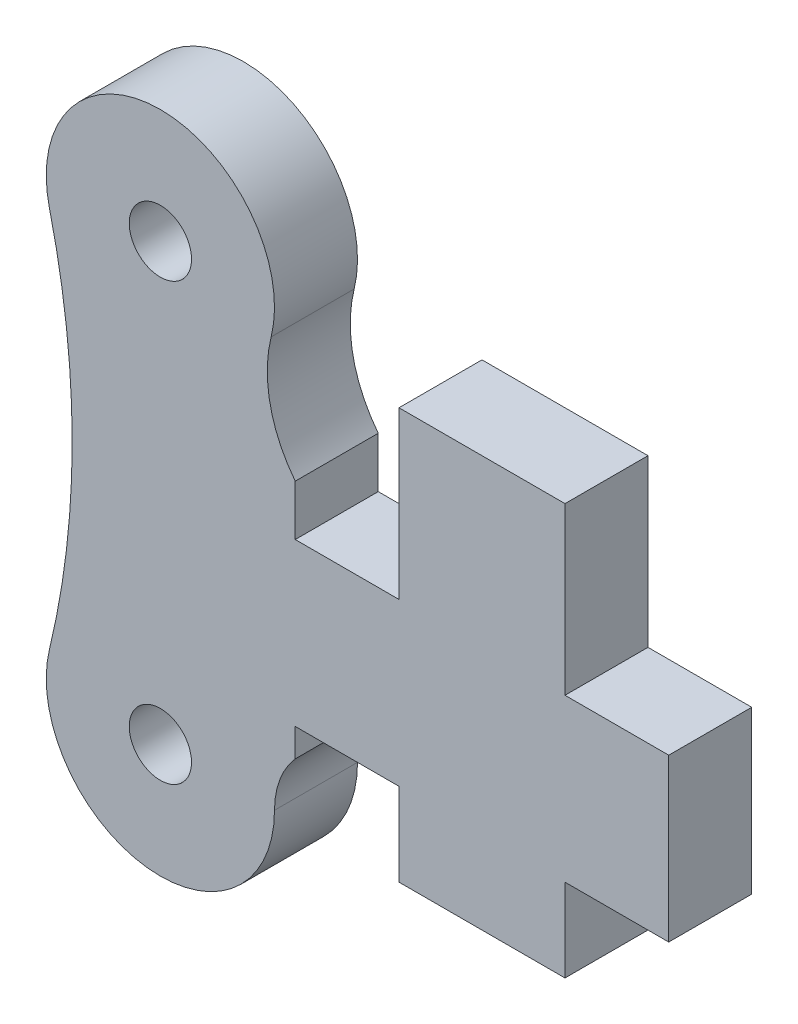
ISO-10303-21;
HEADER;
FILE_DESCRIPTION(('STEP AP214'),'2;1');
FILE_NAME('part.step','',(''),(''),'','','');
FILE_SCHEMA(('AUTOMOTIVE_DESIGN { 1 0 10303 214 1 1 1 1 }'));
ENDSEC;
DATA;
#1=APPLICATION_CONTEXT('core data for automotive mechanical design processes');
#2=APPLICATION_PROTOCOL_DEFINITION('international standard','automotive_design',2000,#1);
#3=PRODUCT_CONTEXT('',#1,'mechanical');
#4=PRODUCT('Part','Part','',(#3));
#5=PRODUCT_RELATED_PRODUCT_CATEGORY('part','',(#4));
#6=PRODUCT_DEFINITION_FORMATION('','',#4);
#7=PRODUCT_DEFINITION_CONTEXT('part definition',#1,'design');
#8=PRODUCT_DEFINITION('design','',#6,#7);
#9=PRODUCT_DEFINITION_SHAPE('','',#8);
#10=(LENGTH_UNIT() NAMED_UNIT(*) SI_UNIT(.MILLI.,.METRE.));
#11=(NAMED_UNIT(*) PLANE_ANGLE_UNIT() SI_UNIT($,.RADIAN.));
#12=(NAMED_UNIT(*) SI_UNIT($,.STERADIAN.) SOLID_ANGLE_UNIT());
#13=UNCERTAINTY_MEASURE_WITH_UNIT(LENGTH_MEASURE(1.E-05),#10,'distance_accuracy_value','');
#14=(GEOMETRIC_REPRESENTATION_CONTEXT(3) GLOBAL_UNCERTAINTY_ASSIGNED_CONTEXT((#13)) GLOBAL_UNIT_ASSIGNED_CONTEXT((#10,
#11,#12)) REPRESENTATION_CONTEXT('',''));
#15=CARTESIAN_POINT('',(0.,0.,0.));
#16=DIRECTION('',(0.,0.,1.));
#17=DIRECTION('',(1.,0.,0.));
#18=AXIS2_PLACEMENT_3D('',#15,#16,#17);
#19=CARTESIAN_POINT('',(0.,-21.,4.));
#20=DIRECTION('',(0.,0.,-1.));
#21=DIRECTION('',(-1.,0.,0.));
#22=AXIS2_PLACEMENT_3D('',#19,#20,#21);
#23=CYLINDRICAL_SURFACE('',#22,5.5);
#24=CARTESIAN_POINT('',(0.,-21.,0.));
#25=DIRECTION('',(0.,0.,1.));
#26=DIRECTION('',(1.,0.,0.));
#27=AXIS2_PLACEMENT_3D('',#24,#25,#26);
#28=CIRCLE('',#27,5.5);
#29=CARTESIAN_POINT('',(-5.34628283957518,-19.7087758524315,0.));
#30=VERTEX_POINT('',#29);
#31=CARTESIAN_POINT('',(5.5,-21.,0.));
#32=VERTEX_POINT('',#31);
#33=EDGE_CURVE('E269',#30,#32,#28,.T.);
#34=ORIENTED_EDGE('',*,*,#33,.T.);
#35=DIRECTION('',(0.,0.,-1.));
#36=VECTOR('',#35,1.);
#37=CARTESIAN_POINT('',(5.5,-21.,4.));
#38=LINE('',#37,#36);
#39=CARTESIAN_POINT('',(5.5,-21.,4.));
#40=VERTEX_POINT('',#39);
#41=EDGE_CURVE('E49',#40,#32,#38,.T.);
#42=ORIENTED_EDGE('',*,*,#41,.F.);
#43=CARTESIAN_POINT('',(0.,-21.,4.));
#44=DIRECTION('',(0.,0.,1.));
#45=DIRECTION('',(1.,0.,0.));
#46=AXIS2_PLACEMENT_3D('',#43,#44,#45);
#47=CIRCLE('',#46,5.5);
#48=CARTESIAN_POINT('',(-5.34628283957518,-19.7087758524315,4.));
#49=VERTEX_POINT('',#48);
#50=EDGE_CURVE('E214',#49,#40,#47,.T.);
#51=ORIENTED_EDGE('',*,*,#50,.F.);
#52=DIRECTION('',(0.,0.,-1.));
#53=VECTOR('',#52,1.);
#54=CARTESIAN_POINT('',(-5.34628283957518,-19.7087758524315,4.));
#55=LINE('',#54,#53);
#56=EDGE_CURVE('E215',#49,#30,#55,.T.);
#57=ORIENTED_EDGE('',*,*,#56,.T.);
#58=EDGE_LOOP('',(#34,#42,#51,#57));
#59=FACE_BOUND('',#58,.T.);
#60=ADVANCED_FACE('F41',(#59),#23,.T.);
#61=CARTESIAN_POINT('',(9.5,-21.,4.));
#62=DIRECTION('',(0.,0.,-1.));
#63=DIRECTION('',(-1.,0.,0.));
#64=AXIS2_PLACEMENT_3D('',#61,#62,#63);
#65=CYLINDRICAL_SURFACE('',#64,4.);
#66=CARTESIAN_POINT('',(9.5,-21.,0.));
#67=DIRECTION('',(0.,0.,1.));
#68=DIRECTION('',(1.,0.,0.));
#69=AXIS2_PLACEMENT_3D('',#66,#67,#68);
#70=CIRCLE('',#69,4.);
#71=CARTESIAN_POINT('',(6.50000000000007,-18.3542486889353,0.));
#72=VERTEX_POINT('',#71);
#73=EDGE_CURVE('E262',#32,#72,#70,.F.);
#74=ORIENTED_EDGE('',*,*,#73,.T.);
#75=DIRECTION('',(0.,0.,-1.));
#76=VECTOR('',#75,1.);
#77=CARTESIAN_POINT('',(6.50000000000007,-18.3542486889353,4.));
#78=LINE('',#77,#76);
#79=CARTESIAN_POINT('',(6.50000000000007,-18.3542486889353,4.));
#80=VERTEX_POINT('',#79);
#81=EDGE_CURVE('E278',#72,#80,#78,.F.);
#82=ORIENTED_EDGE('',*,*,#81,.T.);
#83=CARTESIAN_POINT('',(9.5,-21.,4.));
#84=DIRECTION('',(0.,0.,1.));
#85=DIRECTION('',(1.,0.,0.));
#86=AXIS2_PLACEMENT_3D('',#83,#84,#85);
#87=CIRCLE('',#86,4.);
#88=EDGE_CURVE('E264',#40,#80,#87,.F.);
#89=ORIENTED_EDGE('',*,*,#88,.F.);
#90=ORIENTED_EDGE('',*,*,#41,.T.);
#91=EDGE_LOOP('',(#74,#82,#89,#90));
#92=FACE_BOUND('',#91,.T.);
#93=ADVANCED_FACE('F260',(#92),#65,.F.);
#94=CARTESIAN_POINT('',(0.,-17.,4.));
#95=DIRECTION('',(0.,1.,0.));
#96=DIRECTION('',(0.,0.,1.));
#97=AXIS2_PLACEMENT_3D('',#94,#95,#96);
#98=PLANE('',#97);
#99=DIRECTION('',(1.,0.,0.));
#100=VECTOR('',#99,1.);
#101=CARTESIAN_POINT('',(0.,-17.,0.));
#102=LINE('',#101,#100);
#103=CARTESIAN_POINT('',(6.50000000000007,-17.,0.));
#104=VERTEX_POINT('',#103);
#105=CARTESIAN_POINT('',(11.5,-17.,0.));
#106=VERTEX_POINT('',#105);
#107=EDGE_CURVE('E64',#104,#106,#102,.T.);
#108=ORIENTED_EDGE('',*,*,#107,.T.);
#109=DIRECTION('',(0.,0.,-1.));
#110=VECTOR('',#109,1.);
#111=CARTESIAN_POINT('',(11.5,-17.,4.));
#112=LINE('',#111,#110);
#113=CARTESIAN_POINT('',(11.5,-17.,4.));
#114=VERTEX_POINT('',#113);
#115=EDGE_CURVE('E251',#114,#106,#112,.T.);
#116=ORIENTED_EDGE('',*,*,#115,.F.);
#117=DIRECTION('',(1.,0.,0.));
#118=VECTOR('',#117,1.);
#119=CARTESIAN_POINT('',(0.,-17.,4.));
#120=LINE('',#119,#118);
#121=CARTESIAN_POINT('',(6.50000000000007,-17.,4.));
#122=VERTEX_POINT('',#121);
#123=EDGE_CURVE('E517',#122,#114,#120,.T.);
#124=ORIENTED_EDGE('',*,*,#123,.F.);
#125=DIRECTION('',(0.,0.,1.));
#126=VECTOR('',#125,1.);
#127=CARTESIAN_POINT('',(6.50000000000007,-17.,0.));
#128=LINE('',#127,#126);
#129=EDGE_CURVE('E508',#104,#122,#128,.T.);
#130=ORIENTED_EDGE('',*,*,#129,.F.);
#131=EDGE_LOOP('',(#108,#116,#124,#130));
#132=FACE_BOUND('',#131,.T.);
#133=ADVANCED_FACE('F366',(#132),#98,.F.);
#134=CARTESIAN_POINT('',(11.5,0.,4.));
#135=DIRECTION('',(1.,0.,0.));
#136=DIRECTION('',(0.,0.,-1.));
#137=AXIS2_PLACEMENT_3D('',#134,#135,#136);
#138=PLANE('',#137);
#139=DIRECTION('',(0.,-1.,0.));
#140=VECTOR('',#139,1.);
#141=CARTESIAN_POINT('',(11.5,0.,0.));
#142=LINE('',#141,#140);
#143=CARTESIAN_POINT('',(11.5,-21.,0.));
#144=VERTEX_POINT('',#143);
#145=EDGE_CURVE('E285',#106,#144,#142,.T.);
#146=ORIENTED_EDGE('',*,*,#145,.T.);
#147=DIRECTION('',(0.,0.,-1.));
#148=VECTOR('',#147,1.);
#149=CARTESIAN_POINT('',(11.5,-21.,4.));
#150=LINE('',#149,#148);
#151=CARTESIAN_POINT('',(11.5,-21.,4.));
#152=VERTEX_POINT('',#151);
#153=EDGE_CURVE('E247',#152,#144,#150,.T.);
#154=ORIENTED_EDGE('',*,*,#153,.F.);
#155=DIRECTION('',(0.,-1.,0.));
#156=VECTOR('',#155,1.);
#157=CARTESIAN_POINT('',(11.5,0.,4.));
#158=LINE('',#157,#156);
#159=EDGE_CURVE('E523',#114,#152,#158,.T.);
#160=ORIENTED_EDGE('',*,*,#159,.F.);
#161=ORIENTED_EDGE('',*,*,#115,.T.);
#162=EDGE_LOOP('',(#146,#154,#160,#161));
#163=FACE_BOUND('',#162,.T.);
#164=ADVANCED_FACE('F370',(#163),#138,.F.);
#165=CARTESIAN_POINT('',(0.,-21.,4.));
#166=DIRECTION('',(0.,1.,0.));
#167=DIRECTION('',(0.,0.,1.));
#168=AXIS2_PLACEMENT_3D('',#165,#166,#167);
#169=PLANE('',#168);
#170=DIRECTION('',(1.,0.,0.));
#171=VECTOR('',#170,1.);
#172=CARTESIAN_POINT('',(0.,-21.,0.));
#173=LINE('',#172,#171);
#174=CARTESIAN_POINT('',(19.5,-21.,0.));
#175=VERTEX_POINT('',#174);
#176=EDGE_CURVE('E289',#144,#175,#173,.T.);
#177=ORIENTED_EDGE('',*,*,#176,.T.);
#178=DIRECTION('',(0.,0.,-1.));
#179=VECTOR('',#178,1.);
#180=CARTESIAN_POINT('',(19.5,-21.,4.));
#181=LINE('',#180,#179);
#182=CARTESIAN_POINT('',(19.5,-21.,4.));
#183=VERTEX_POINT('',#182);
#184=EDGE_CURVE('E244',#183,#175,#181,.T.);
#185=ORIENTED_EDGE('',*,*,#184,.F.);
#186=DIRECTION('',(1.,0.,0.));
#187=VECTOR('',#186,1.);
#188=CARTESIAN_POINT('',(0.,-21.,4.));
#189=LINE('',#188,#187);
#190=EDGE_CURVE('E527',#152,#183,#189,.T.);
#191=ORIENTED_EDGE('',*,*,#190,.F.);
#192=ORIENTED_EDGE('',*,*,#153,.T.);
#193=EDGE_LOOP('',(#177,#185,#191,#192));
#194=FACE_BOUND('',#193,.T.);
#195=ADVANCED_FACE('F377',(#194),#169,.F.);
#196=CARTESIAN_POINT('',(19.5,0.,4.));
#197=DIRECTION('',(1.,0.,0.));
#198=DIRECTION('',(0.,0.,-1.));
#199=AXIS2_PLACEMENT_3D('',#196,#197,#198);
#200=PLANE('',#199);
#201=DIRECTION('',(0.,-1.,0.));
#202=VECTOR('',#201,1.);
#203=CARTESIAN_POINT('',(19.5,0.,0.));
#204=LINE('',#203,#202);
#205=CARTESIAN_POINT('',(19.5,-17.,0.));
#206=VERTEX_POINT('',#205);
#207=EDGE_CURVE('E293',#206,#175,#204,.T.);
#208=ORIENTED_EDGE('',*,*,#207,.F.);
#209=DIRECTION('',(0.,0.,-1.));
#210=VECTOR('',#209,1.);
#211=CARTESIAN_POINT('',(19.5,-17.,4.));
#212=LINE('',#211,#210);
#213=CARTESIAN_POINT('',(19.5,-17.,4.));
#214=VERTEX_POINT('',#213);
#215=EDGE_CURVE('E241',#214,#206,#212,.T.);
#216=ORIENTED_EDGE('',*,*,#215,.F.);
#217=DIRECTION('',(0.,-1.,0.));
#218=VECTOR('',#217,1.);
#219=CARTESIAN_POINT('',(19.5,0.,4.));
#220=LINE('',#219,#218);
#221=EDGE_CURVE('E530',#214,#183,#220,.T.);
#222=ORIENTED_EDGE('',*,*,#221,.T.);
#223=ORIENTED_EDGE('',*,*,#184,.T.);
#224=EDGE_LOOP('',(#208,#216,#222,#223));
#225=FACE_BOUND('',#224,.T.);
#226=ADVANCED_FACE('F381',(#225),#200,.T.);
#227=CARTESIAN_POINT('',(24.5,-17.,0.));
#228=VERTEX_POINT('',#227);
#229=EDGE_CURVE('E286',#206,#228,#102,.T.);
#230=ORIENTED_EDGE('',*,*,#229,.T.);
#231=DIRECTION('',(0.,0.,-1.));
#232=VECTOR('',#231,1.);
#233=CARTESIAN_POINT('',(24.5,-17.,4.));
#234=LINE('',#233,#232);
#235=CARTESIAN_POINT('',(24.5,-17.,4.));
#236=VERTEX_POINT('',#235);
#237=EDGE_CURVE('E238',#236,#228,#234,.T.);
#238=ORIENTED_EDGE('',*,*,#237,.F.);
#239=EDGE_CURVE('E524',#214,#236,#120,.T.);
#240=ORIENTED_EDGE('',*,*,#239,.F.);
#241=ORIENTED_EDGE('',*,*,#215,.T.);
#242=EDGE_LOOP('',(#230,#238,#240,#241));
#243=FACE_BOUND('',#242,.T.);
#244=ADVANCED_FACE('F373',(#243),#98,.F.);
#245=CARTESIAN_POINT('',(24.5,0.,4.));
#246=DIRECTION('',(1.,0.,0.));
#247=DIRECTION('',(0.,1.,0.));
#248=AXIS2_PLACEMENT_3D('',#245,#246,#247);
#249=PLANE('',#248);
#250=DIRECTION('',(0.,-1.,0.));
#251=VECTOR('',#250,1.);
#252=CARTESIAN_POINT('',(24.5,0.,0.));
#253=LINE('',#252,#251);
#254=CARTESIAN_POINT('',(24.5,-9.2,0.));
#255=VERTEX_POINT('',#254);
#256=EDGE_CURVE('E297',#255,#228,#253,.T.);
#257=ORIENTED_EDGE('',*,*,#256,.F.);
#258=DIRECTION('',(0.,0.,-1.));
#259=VECTOR('',#258,1.);
#260=CARTESIAN_POINT('',(24.5,-9.2,4.));
#261=LINE('',#260,#259);
#262=CARTESIAN_POINT('',(24.5,-9.2,4.));
#263=VERTEX_POINT('',#262);
#264=EDGE_CURVE('E235',#263,#255,#261,.T.);
#265=ORIENTED_EDGE('',*,*,#264,.F.);
#266=DIRECTION('',(0.,-1.,0.));
#267=VECTOR('',#266,1.);
#268=CARTESIAN_POINT('',(24.5,0.,4.));
#269=LINE('',#268,#267);
#270=EDGE_CURVE('E534',#263,#236,#269,.T.);
#271=ORIENTED_EDGE('',*,*,#270,.T.);
#272=ORIENTED_EDGE('',*,*,#237,.T.);
#273=EDGE_LOOP('',(#257,#265,#271,#272));
#274=FACE_BOUND('',#273,.T.);
#275=ADVANCED_FACE('F387',(#274),#249,.T.);
#276=CARTESIAN_POINT('',(0.,-9.2,4.));
#277=DIRECTION('',(0.,1.,0.));
#278=DIRECTION('',(-1.,0.,0.));
#279=AXIS2_PLACEMENT_3D('',#276,#277,#278);
#280=PLANE('',#279);
#281=DIRECTION('',(1.,0.,0.));
#282=VECTOR('',#281,1.);
#283=CARTESIAN_POINT('',(0.,-9.2,0.));
#284=LINE('',#283,#282);
#285=CARTESIAN_POINT('',(19.5,-9.2,0.));
#286=VERTEX_POINT('',#285);
#287=EDGE_CURVE('E301',#286,#255,#284,.T.);
#288=ORIENTED_EDGE('',*,*,#287,.F.);
#289=DIRECTION('',(0.,0.,-1.));
#290=VECTOR('',#289,1.);
#291=CARTESIAN_POINT('',(19.5,-9.2,4.));
#292=LINE('',#291,#290);
#293=CARTESIAN_POINT('',(19.5,-9.2,4.));
#294=VERTEX_POINT('',#293);
#295=EDGE_CURVE('E232',#294,#286,#292,.T.);
#296=ORIENTED_EDGE('',*,*,#295,.F.);
#297=DIRECTION('',(1.,0.,0.));
#298=VECTOR('',#297,1.);
#299=CARTESIAN_POINT('',(0.,-9.2,4.));
#300=LINE('',#299,#298);
#301=EDGE_CURVE('E325',#294,#263,#300,.T.);
#302=ORIENTED_EDGE('',*,*,#301,.T.);
#303=ORIENTED_EDGE('',*,*,#264,.T.);
#304=EDGE_LOOP('',(#288,#296,#302,#303));
#305=FACE_BOUND('',#304,.T.);
#306=ADVANCED_FACE('F391',(#305),#280,.T.);
#307=CARTESIAN_POINT('',(19.5,0.,4.));
#308=DIRECTION('',(-1.,0.,0.));
#309=DIRECTION('',(0.,-1.,0.));
#310=AXIS2_PLACEMENT_3D('',#307,#308,#309);
#311=PLANE('',#310);
#312=DIRECTION('',(0.,1.,0.));
#313=VECTOR('',#312,1.);
#314=CARTESIAN_POINT('',(19.5,0.,0.));
#315=LINE('',#314,#313);
#316=CARTESIAN_POINT('',(19.5,-1.2,0.));
#317=VERTEX_POINT('',#316);
#318=EDGE_CURVE('E197',#286,#317,#315,.T.);
#319=ORIENTED_EDGE('',*,*,#318,.T.);
#320=DIRECTION('',(0.,0.,-1.));
#321=VECTOR('',#320,1.);
#322=CARTESIAN_POINT('',(19.5,-1.2,4.));
#323=LINE('',#322,#321);
#324=CARTESIAN_POINT('',(19.5,-1.2,4.));
#325=VERTEX_POINT('',#324);
#326=EDGE_CURVE('E228',#325,#317,#323,.T.);
#327=ORIENTED_EDGE('',*,*,#326,.F.);
#328=DIRECTION('',(0.,1.,0.));
#329=VECTOR('',#328,1.);
#330=CARTESIAN_POINT('',(19.5,0.,4.));
#331=LINE('',#330,#329);
#332=EDGE_CURVE('E319',#294,#325,#331,.T.);
#333=ORIENTED_EDGE('',*,*,#332,.F.);
#334=ORIENTED_EDGE('',*,*,#295,.T.);
#335=EDGE_LOOP('',(#319,#327,#333,#334));
#336=FACE_BOUND('',#335,.T.);
#337=ADVANCED_FACE('F308',(#336),#311,.F.);
#338=CARTESIAN_POINT('',(0.,-1.2,4.));
#339=DIRECTION('',(0.,-1.,0.));
#340=DIRECTION('',(0.,0.,-1.));
#341=AXIS2_PLACEMENT_3D('',#338,#339,#340);
#342=PLANE('',#341);
#343=DIRECTION('',(-1.,0.,0.));
#344=VECTOR('',#343,1.);
#345=CARTESIAN_POINT('',(0.,-1.2,0.));
#346=LINE('',#345,#344);
#347=CARTESIAN_POINT('',(11.5,-1.2,0.));
#348=VERTEX_POINT('',#347);
#349=EDGE_CURVE('E191',#317,#348,#346,.T.);
#350=ORIENTED_EDGE('',*,*,#349,.T.);
#351=DIRECTION('',(0.,0.,-1.));
#352=VECTOR('',#351,1.);
#353=CARTESIAN_POINT('',(11.5,-1.2,4.));
#354=LINE('',#353,#352);
#355=CARTESIAN_POINT('',(11.5,-1.2,4.));
#356=VERTEX_POINT('',#355);
#357=EDGE_CURVE('E174',#356,#348,#354,.T.);
#358=ORIENTED_EDGE('',*,*,#357,.F.);
#359=DIRECTION('',(-1.,0.,0.));
#360=VECTOR('',#359,1.);
#361=CARTESIAN_POINT('',(0.,-1.2,4.));
#362=LINE('',#361,#360);
#363=EDGE_CURVE('E315',#325,#356,#362,.T.);
#364=ORIENTED_EDGE('',*,*,#363,.F.);
#365=ORIENTED_EDGE('',*,*,#326,.T.);
#366=EDGE_LOOP('',(#350,#358,#364,#365));
#367=FACE_BOUND('',#366,.T.);
#368=ADVANCED_FACE('F313',(#367),#342,.F.);
#369=CARTESIAN_POINT('',(11.5,0.,4.));
#370=DIRECTION('',(-1.,0.,0.));
#371=DIRECTION('',(0.,-1.,0.));
#372=AXIS2_PLACEMENT_3D('',#369,#370,#371);
#373=PLANE('',#372);
#374=ORIENTED_EDGE('',*,*,#357,.T.);
#375=DIRECTION('',(0.,1.,0.));
#376=VECTOR('',#375,1.);
#377=CARTESIAN_POINT('',(11.5,0.,0.));
#378=LINE('',#377,#376);
#379=CARTESIAN_POINT('',(11.5,-9.2,0.));
#380=VERTEX_POINT('',#379);
#381=EDGE_CURVE('E180',#380,#348,#378,.T.);
#382=ORIENTED_EDGE('',*,*,#381,.F.);
#383=DIRECTION('',(0.,0.,-1.));
#384=VECTOR('',#383,1.);
#385=CARTESIAN_POINT('',(11.5,-9.2,4.));
#386=LINE('',#385,#384);
#387=CARTESIAN_POINT('',(11.5,-9.2,4.));
#388=VERTEX_POINT('',#387);
#389=EDGE_CURVE('E166',#388,#380,#386,.T.);
#390=ORIENTED_EDGE('',*,*,#389,.F.);
#391=DIRECTION('',(0.,1.,0.));
#392=VECTOR('',#391,1.);
#393=CARTESIAN_POINT('',(11.5,0.,4.));
#394=LINE('',#393,#392);
#395=EDGE_CURVE('E318',#388,#356,#394,.T.);
#396=ORIENTED_EDGE('',*,*,#395,.T.);
#397=EDGE_LOOP('',(#374,#382,#390,#396));
#398=FACE_BOUND('',#397,.T.);
#399=ADVANCED_FACE('F186',(#398),#373,.T.);
#400=CARTESIAN_POINT('',(11.5,-2.85170068027211,4.));
#401=DIRECTION('',(0.,0.,-1.));
#402=DIRECTION('',(-1.,0.,0.));
#403=AXIS2_PLACEMENT_3D('',#400,#401,#402);
#404=CYLINDRICAL_SURFACE('',#403,6.34829931972789);
#405=DIRECTION('',(0.,0.,-1.));
#406=VECTOR('',#405,1.);
#407=CARTESIAN_POINT('',(6.5,-6.76333771006637,4.));
#408=LINE('',#407,#406);
#409=CARTESIAN_POINT('',(6.5,-6.76333771006637,0.));
#410=VERTEX_POINT('',#409);
#411=CARTESIAN_POINT('',(6.5,-6.76333771006637,4.));
#412=VERTEX_POINT('',#411);
#413=EDGE_CURVE('E273',#410,#412,#408,.F.);
#414=ORIENTED_EDGE('',*,*,#413,.F.);
#415=CARTESIAN_POINT('',(11.5,-2.85170068027211,0.));
#416=DIRECTION('',(0.,0.,1.));
#417=DIRECTION('',(1.,0.,0.));
#418=AXIS2_PLACEMENT_3D('',#415,#416,#417);
#419=CIRCLE('',#418,6.34829931972789);
#420=CARTESIAN_POINT('',(5.33831888384911,-1.32376413848539,0.));
#421=VERTEX_POINT('',#420);
#422=EDGE_CURVE('E190',#421,#410,#419,.T.);
#423=ORIENTED_EDGE('',*,*,#422,.F.);
#424=DIRECTION('',(0.,0.,-1.));
#425=VECTOR('',#424,1.);
#426=CARTESIAN_POINT('',(5.33831888384911,-1.32376413848539,4.));
#427=LINE('',#426,#425);
#428=CARTESIAN_POINT('',(5.33831888384911,-1.32376413848539,4.));
#429=VERTEX_POINT('',#428);
#430=EDGE_CURVE('E175',#429,#421,#427,.T.);
#431=ORIENTED_EDGE('',*,*,#430,.F.);
#432=CARTESIAN_POINT('',(11.5,-2.85170068027211,4.));
#433=DIRECTION('',(0.,0.,1.));
#434=DIRECTION('',(1.,0.,0.));
#435=AXIS2_PLACEMENT_3D('',#432,#433,#434);
#436=CIRCLE('',#435,6.34829931972789);
#437=EDGE_CURVE('E323',#429,#412,#436,.T.);
#438=ORIENTED_EDGE('',*,*,#437,.T.);
#439=EDGE_LOOP('',(#414,#423,#431,#438));
#440=FACE_BOUND('',#439,.T.);
#441=ADVANCED_FACE('F402',(#440),#404,.F.);
#442=CARTESIAN_POINT('',(0.,0.,4.));
#443=DIRECTION('',(0.,0.,-1.));
#444=DIRECTION('',(-1.,0.,0.));
#445=AXIS2_PLACEMENT_3D('',#442,#443,#444);
#446=CYLINDRICAL_SURFACE('',#445,5.5);
#447=CARTESIAN_POINT('',(0.,0.,0.));
#448=DIRECTION('',(0.,0.,1.));
#449=DIRECTION('',(1.,0.,0.));
#450=AXIS2_PLACEMENT_3D('',#447,#448,#449);
#451=CIRCLE('',#450,5.5);
#452=CARTESIAN_POINT('',(-5.34628283957518,-1.29122414756847,0.));
#453=VERTEX_POINT('',#452);
#454=EDGE_CURVE('E195',#421,#453,#451,.T.);
#455=ORIENTED_EDGE('',*,*,#454,.T.);
#456=DIRECTION('',(0.,0.,-1.));
#457=VECTOR('',#456,1.);
#458=CARTESIAN_POINT('',(-5.34628283957518,-1.29122414756847,4.));
#459=LINE('',#458,#457);
#460=CARTESIAN_POINT('',(-5.34628283957518,-1.29122414756847,4.));
#461=VERTEX_POINT('',#460);
#462=EDGE_CURVE('E219',#461,#453,#459,.T.);
#463=ORIENTED_EDGE('',*,*,#462,.F.);
#464=CARTESIAN_POINT('',(0.,0.,4.));
#465=DIRECTION('',(0.,0.,1.));
#466=DIRECTION('',(1.,0.,0.));
#467=AXIS2_PLACEMENT_3D('',#464,#465,#466);
#468=CIRCLE('',#467,5.5);
#469=EDGE_CURVE('E332',#429,#461,#468,.T.);
#470=ORIENTED_EDGE('',*,*,#469,.F.);
#471=ORIENTED_EDGE('',*,*,#430,.T.);
#472=EDGE_LOOP('',(#455,#463,#470,#471));
#473=FACE_BOUND('',#472,.T.);
#474=ADVANCED_FACE('F405',(#473),#446,.T.);
#475=CARTESIAN_POINT('',(0.,0.,4.));
#476=DIRECTION('',(0.,0.,-1.));
#477=DIRECTION('',(-1.,0.,0.));
#478=AXIS2_PLACEMENT_3D('',#475,#476,#477);
#479=CYLINDRICAL_SURFACE('',#478,1.5);
#480=CARTESIAN_POINT('',(0.,0.,4.));
#481=DIRECTION('',(0.,0.,1.));
#482=DIRECTION('',(1.,0.,0.));
#483=AXIS2_PLACEMENT_3D('',#480,#481,#482);
#484=CIRCLE('',#483,1.5);
#485=CARTESIAN_POINT('',(1.5,0.,4.));
#486=VERTEX_POINT('',#485);
#487=EDGE_CURVE('E337',#486,#486,#484,.T.);
#488=ORIENTED_EDGE('',*,*,#487,.T.);
#489=EDGE_LOOP('',(#488));
#490=FACE_BOUND('',#489,.T.);
#491=CARTESIAN_POINT('',(0.,0.,0.));
#492=DIRECTION('',(0.,0.,1.));
#493=DIRECTION('',(1.,0.,0.));
#494=AXIS2_PLACEMENT_3D('',#491,#492,#493);
#495=CIRCLE('',#494,1.5);
#496=CARTESIAN_POINT('',(1.5,0.,0.));
#497=VERTEX_POINT('',#496);
#498=EDGE_CURVE('E206',#497,#497,#495,.T.);
#499=ORIENTED_EDGE('',*,*,#498,.F.);
#500=EDGE_LOOP('',(#499));
#501=FACE_BOUND('',#500,.T.);
#502=ADVANCED_FACE('F409',(#490,#501),#479,.F.);
#503=CARTESIAN_POINT('',(-43.475,-10.5,4.));
#504=DIRECTION('',(0.,0.,-1.));
#505=DIRECTION('',(-1.,0.,0.));
#506=AXIS2_PLACEMENT_3D('',#503,#504,#505);
#507=CYLINDRICAL_SURFACE('',#506,39.225);
#508=CARTESIAN_POINT('',(-43.475,-10.5,0.));
#509=DIRECTION('',(0.,0.,1.));
#510=DIRECTION('',(1.,0.,0.));
#511=AXIS2_PLACEMENT_3D('',#508,#509,#510);
#512=CIRCLE('',#511,39.225);
#513=EDGE_CURVE('E203',#453,#30,#512,.F.);
#514=ORIENTED_EDGE('',*,*,#513,.T.);
#515=ORIENTED_EDGE('',*,*,#56,.F.);
#516=CARTESIAN_POINT('',(-43.475,-10.5,4.));
#517=DIRECTION('',(0.,0.,1.));
#518=DIRECTION('',(1.,0.,0.));
#519=AXIS2_PLACEMENT_3D('',#516,#517,#518);
#520=CIRCLE('',#519,39.225);
#521=EDGE_CURVE('E335',#461,#49,#520,.F.);
#522=ORIENTED_EDGE('',*,*,#521,.F.);
#523=ORIENTED_EDGE('',*,*,#462,.T.);
#524=EDGE_LOOP('',(#514,#515,#522,#523));
#525=FACE_BOUND('',#524,.T.);
#526=ADVANCED_FACE('F358',(#525),#507,.F.);
#527=CARTESIAN_POINT('',(0.,-21.,4.));
#528=DIRECTION('',(0.,0.,-1.));
#529=DIRECTION('',(-1.,0.,0.));
#530=AXIS2_PLACEMENT_3D('',#527,#528,#529);
#531=CYLINDRICAL_SURFACE('',#530,1.5);
#532=CARTESIAN_POINT('',(0.,-21.,4.));
#533=DIRECTION('',(0.,0.,1.));
#534=DIRECTION('',(1.,0.,0.));
#535=AXIS2_PLACEMENT_3D('',#532,#533,#534);
#536=CIRCLE('',#535,1.5);
#537=CARTESIAN_POINT('',(1.50000000000001,-21.,4.));
#538=VERTEX_POINT('',#537);
#539=EDGE_CURVE('E220',#538,#538,#536,.T.);
#540=ORIENTED_EDGE('',*,*,#539,.T.);
#541=EDGE_LOOP('',(#540));
#542=FACE_BOUND('',#541,.T.);
#543=CARTESIAN_POINT('',(0.,-21.,0.));
#544=DIRECTION('',(0.,0.,1.));
#545=DIRECTION('',(1.,0.,0.));
#546=AXIS2_PLACEMENT_3D('',#543,#544,#545);
#547=CIRCLE('',#546,1.5);
#548=CARTESIAN_POINT('',(1.50000000000001,-21.,0.));
#549=VERTEX_POINT('',#548);
#550=EDGE_CURVE('E210',#549,#549,#547,.T.);
#551=ORIENTED_EDGE('',*,*,#550,.F.);
#552=EDGE_LOOP('',(#551));
#553=FACE_BOUND('',#552,.T.);
#554=ADVANCED_FACE('F346',(#542,#553),#531,.F.);
#555=CARTESIAN_POINT('',(0.,0.,4.));
#556=DIRECTION('',(0.,0.,1.));
#557=DIRECTION('',(1.,0.,0.));
#558=AXIS2_PLACEMENT_3D('',#555,#556,#557);
#559=PLANE('',#558);
#560=DIRECTION('',(1.,0.,0.));
#561=VECTOR('',#560,1.);
#562=CARTESIAN_POINT('',(11.5,-9.2,4.));
#563=LINE('',#562,#561);
#564=CARTESIAN_POINT('',(6.5,-9.2,4.));
#565=VERTEX_POINT('',#564);
#566=EDGE_CURVE('E169',#565,#388,#563,.T.);
#567=ORIENTED_EDGE('',*,*,#566,.F.);
#568=DIRECTION('',(0.,-1.,0.));
#569=VECTOR('',#568,1.);
#570=CARTESIAN_POINT('',(6.5,-9.2,4.));
#571=LINE('',#570,#569);
#572=EDGE_CURVE('E504',#412,#565,#571,.T.);
#573=ORIENTED_EDGE('',*,*,#572,.F.);
#574=ORIENTED_EDGE('',*,*,#437,.F.);
#575=ORIENTED_EDGE('',*,*,#469,.T.);
#576=ORIENTED_EDGE('',*,*,#521,.T.);
#577=ORIENTED_EDGE('',*,*,#50,.T.);
#578=ORIENTED_EDGE('',*,*,#88,.T.);
#579=DIRECTION('',(0.,-1.,0.));
#580=VECTOR('',#579,1.);
#581=CARTESIAN_POINT('',(6.50000000000007,-17.,4.));
#582=LINE('',#581,#580);
#583=EDGE_CURVE('E562',#122,#80,#582,.T.);
#584=ORIENTED_EDGE('',*,*,#583,.F.);
#585=ORIENTED_EDGE('',*,*,#123,.T.);
#586=ORIENTED_EDGE('',*,*,#159,.T.);
#587=ORIENTED_EDGE('',*,*,#190,.T.);
#588=ORIENTED_EDGE('',*,*,#221,.F.);
#589=ORIENTED_EDGE('',*,*,#239,.T.);
#590=ORIENTED_EDGE('',*,*,#270,.F.);
#591=ORIENTED_EDGE('',*,*,#301,.F.);
#592=ORIENTED_EDGE('',*,*,#332,.T.);
#593=ORIENTED_EDGE('',*,*,#363,.T.);
#594=ORIENTED_EDGE('',*,*,#395,.F.);
#595=EDGE_LOOP('',(#567,#573,#574,#575,#576,#577,#578,#584,#585,#586,#587,#588,#589,#590,#591,
#592,#593,#594));
#596=FACE_BOUND('',#595,.T.);
#597=ORIENTED_EDGE('',*,*,#487,.F.);
#598=EDGE_LOOP('',(#597));
#599=FACE_BOUND('',#598,.T.);
#600=ORIENTED_EDGE('',*,*,#539,.F.);
#601=EDGE_LOOP('',(#600));
#602=FACE_BOUND('',#601,.T.);
#603=ADVANCED_FACE('F349',(#596,#599,#602),#559,.T.);
#604=CARTESIAN_POINT('',(0.,0.,0.));
#605=DIRECTION('',(0.,0.,1.));
#606=DIRECTION('',(1.,0.,0.));
#607=AXIS2_PLACEMENT_3D('',#604,#605,#606);
#608=PLANE('',#607);
#609=DIRECTION('',(0.,-1.,0.));
#610=VECTOR('',#609,1.);
#611=CARTESIAN_POINT('',(6.5,0.,0.));
#612=LINE('',#611,#610);
#613=CARTESIAN_POINT('',(6.5,-9.2,0.));
#614=VERTEX_POINT('',#613);
#615=EDGE_CURVE('E11',#410,#614,#612,.T.);
#616=ORIENTED_EDGE('',*,*,#615,.T.);
#617=DIRECTION('',(1.,0.,0.));
#618=VECTOR('',#617,1.);
#619=CARTESIAN_POINT('',(11.5,-9.2,0.));
#620=LINE('',#619,#618);
#621=EDGE_CURVE('E56',#614,#380,#620,.T.);
#622=ORIENTED_EDGE('',*,*,#621,.T.);
#623=ORIENTED_EDGE('',*,*,#381,.T.);
#624=ORIENTED_EDGE('',*,*,#349,.F.);
#625=ORIENTED_EDGE('',*,*,#318,.F.);
#626=ORIENTED_EDGE('',*,*,#287,.T.);
#627=ORIENTED_EDGE('',*,*,#256,.T.);
#628=ORIENTED_EDGE('',*,*,#229,.F.);
#629=ORIENTED_EDGE('',*,*,#207,.T.);
#630=ORIENTED_EDGE('',*,*,#176,.F.);
#631=ORIENTED_EDGE('',*,*,#145,.F.);
#632=ORIENTED_EDGE('',*,*,#107,.F.);
#633=DIRECTION('',(0.,-1.,0.));
#634=VECTOR('',#633,1.);
#635=CARTESIAN_POINT('',(6.50000000000007,-17.,0.));
#636=LINE('',#635,#634);
#637=EDGE_CURVE('E559',#104,#72,#636,.T.);
#638=ORIENTED_EDGE('',*,*,#637,.T.);
#639=ORIENTED_EDGE('',*,*,#73,.F.);
#640=ORIENTED_EDGE('',*,*,#33,.F.);
#641=ORIENTED_EDGE('',*,*,#513,.F.);
#642=ORIENTED_EDGE('',*,*,#454,.F.);
#643=ORIENTED_EDGE('',*,*,#422,.T.);
#644=EDGE_LOOP('',(#616,#622,#623,#624,#625,#626,#627,#628,#629,#630,#631,#632,#638,#639,#640,
#641,#642,#643));
#645=FACE_BOUND('',#644,.T.);
#646=ORIENTED_EDGE('',*,*,#498,.T.);
#647=EDGE_LOOP('',(#646));
#648=FACE_BOUND('',#647,.T.);
#649=ORIENTED_EDGE('',*,*,#550,.T.);
#650=EDGE_LOOP('',(#649));
#651=FACE_BOUND('',#650,.T.);
#652=ADVANCED_FACE('F177',(#645,#648,#651),#608,.F.);
#653=CARTESIAN_POINT('',(6.50000000000007,-17.,0.));
#654=DIRECTION('',(-1.,0.,0.));
#655=DIRECTION('',(0.,-1.,0.));
#656=AXIS2_PLACEMENT_3D('',#653,#654,#655);
#657=PLANE('',#656);
#658=ORIENTED_EDGE('',*,*,#637,.F.);
#659=ORIENTED_EDGE('',*,*,#129,.T.);
#660=ORIENTED_EDGE('',*,*,#583,.T.);
#661=ORIENTED_EDGE('',*,*,#81,.F.);
#662=EDGE_LOOP('',(#658,#659,#660,#661));
#663=FACE_BOUND('',#662,.T.);
#664=ADVANCED_FACE('F356',(#663),#657,.F.);
#665=CARTESIAN_POINT('',(11.5,-9.2,0.));
#666=DIRECTION('',(0.,-1.,0.));
#667=DIRECTION('',(0.,0.,-1.));
#668=AXIS2_PLACEMENT_3D('',#665,#666,#667);
#669=PLANE('',#668);
#670=ORIENTED_EDGE('',*,*,#566,.T.);
#671=ORIENTED_EDGE('',*,*,#389,.T.);
#672=ORIENTED_EDGE('',*,*,#621,.F.);
#673=DIRECTION('',(0.,0.,1.));
#674=VECTOR('',#673,1.);
#675=CARTESIAN_POINT('',(6.5,-9.2,0.));
#676=LINE('',#675,#674);
#677=EDGE_CURVE('E184',#614,#565,#676,.T.);
#678=ORIENTED_EDGE('',*,*,#677,.T.);
#679=EDGE_LOOP('',(#670,#671,#672,#678));
#680=FACE_BOUND('',#679,.T.);
#681=ADVANCED_FACE('F167',(#680),#669,.F.);
#682=CARTESIAN_POINT('',(6.5,-9.2,0.));
#683=DIRECTION('',(-1.,0.,0.));
#684=DIRECTION('',(0.,0.,1.));
#685=AXIS2_PLACEMENT_3D('',#682,#683,#684);
#686=PLANE('',#685);
#687=ORIENTED_EDGE('',*,*,#413,.T.);
#688=ORIENTED_EDGE('',*,*,#572,.T.);
#689=ORIENTED_EDGE('',*,*,#677,.F.);
#690=ORIENTED_EDGE('',*,*,#615,.F.);
#691=EDGE_LOOP('',(#687,#688,#689,#690));
#692=FACE_BOUND('',#691,.T.);
#693=ADVANCED_FACE('F489',(#692),#686,.F.);
#694=CLOSED_SHELL('',(#60,#93,#133,#164,#195,#226,#244,#275,#306,#337,#368,#399,#441,#474,#502,
#526,#554,#603,#652,#664,#681,#693));
#695=MANIFOLD_SOLID_BREP('B2',#694);
#696=ADVANCED_BREP_SHAPE_REPRESENTATION('',(#18,#695),#14);
#697=SHAPE_DEFINITION_REPRESENTATION(#9,#696);
ENDSEC;
END-ISO-10303-21;
